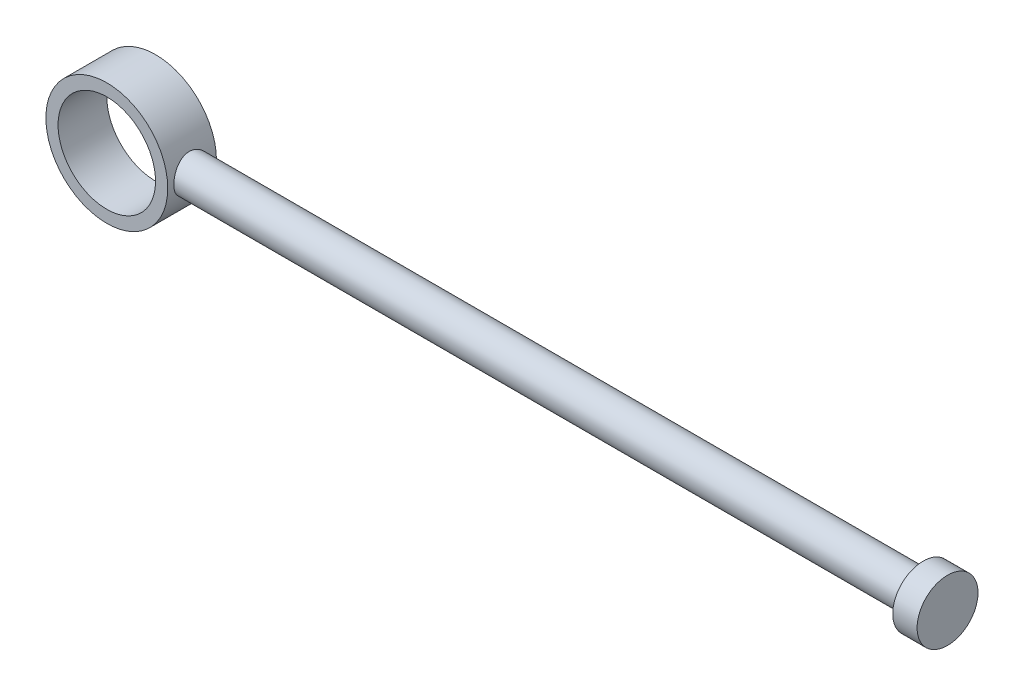
ISO-10303-21;
HEADER;
FILE_DESCRIPTION(('STEP AP214'),'2;1');
FILE_NAME('part.step','',(''),(''),'','','');
FILE_SCHEMA(('AUTOMOTIVE_DESIGN { 1 0 10303 214 1 1 1 1 }'));
ENDSEC;
DATA;
#1=APPLICATION_CONTEXT('core data for automotive mechanical design processes');
#2=APPLICATION_PROTOCOL_DEFINITION('international standard','automotive_design',2000,#1);
#3=PRODUCT_CONTEXT('',#1,'mechanical');
#4=PRODUCT('Part','Part','',(#3));
#5=PRODUCT_RELATED_PRODUCT_CATEGORY('part','',(#4));
#6=PRODUCT_DEFINITION_FORMATION('','',#4);
#7=PRODUCT_DEFINITION_CONTEXT('part definition',#1,'design');
#8=PRODUCT_DEFINITION('design','',#6,#7);
#9=PRODUCT_DEFINITION_SHAPE('','',#8);
#10=(LENGTH_UNIT() NAMED_UNIT(*) SI_UNIT(.MILLI.,.METRE.));
#11=(NAMED_UNIT(*) PLANE_ANGLE_UNIT() SI_UNIT($,.RADIAN.));
#12=(NAMED_UNIT(*) SI_UNIT($,.STERADIAN.) SOLID_ANGLE_UNIT());
#13=UNCERTAINTY_MEASURE_WITH_UNIT(LENGTH_MEASURE(1.E-05),#10,'distance_accuracy_value','');
#14=(GEOMETRIC_REPRESENTATION_CONTEXT(3) GLOBAL_UNCERTAINTY_ASSIGNED_CONTEXT((#13)) GLOBAL_UNIT_ASSIGNED_CONTEXT((#10,
#11,#12)) REPRESENTATION_CONTEXT('',''));
#15=CARTESIAN_POINT('',(0.,0.,0.));
#16=DIRECTION('',(0.,0.,1.));
#17=DIRECTION('',(1.,0.,0.));
#18=AXIS2_PLACEMENT_3D('',#15,#16,#17);
#19=CARTESIAN_POINT('',(0.,0.,4.));
#20=DIRECTION('',(0.,0.,-1.));
#21=DIRECTION('',(-1.,0.,0.));
#22=AXIS2_PLACEMENT_3D('',#19,#20,#21);
#23=CYLINDRICAL_SURFACE('',#22,5.);
#24=CARTESIAN_POINT('',(0.,0.,4.));
#25=DIRECTION('',(0.,0.,1.));
#26=DIRECTION('',(1.,0.,0.));
#27=AXIS2_PLACEMENT_3D('',#24,#25,#26);
#28=CIRCLE('',#27,5.);
#29=CARTESIAN_POINT('',(5.,0.,4.));
#30=VERTEX_POINT('',#29);
#31=EDGE_CURVE('E53',#30,#30,#28,.T.);
#32=ORIENTED_EDGE('',*,*,#31,.F.);
#33=EDGE_LOOP('',(#32));
#34=FACE_BOUND('',#33,.T.);
#35=CARTESIAN_POINT('',(0.,0.,0.));
#36=DIRECTION('',(0.,0.,1.));
#37=DIRECTION('',(1.,0.,0.));
#38=AXIS2_PLACEMENT_3D('',#35,#36,#37);
#39=CIRCLE('',#38,5.);
#40=CARTESIAN_POINT('',(5.,0.,0.));
#41=VERTEX_POINT('',#40);
#42=EDGE_CURVE('E58',#41,#41,#39,.T.);
#43=ORIENTED_EDGE('',*,*,#42,.T.);
#44=EDGE_LOOP('',(#43));
#45=FACE_BOUND('',#44,.T.);
#46=CARTESIAN_POINT('',(5.,0.,3.5));
#47=CARTESIAN_POINT('',(4.9999992925055,-0.0822886127532999,3.49999900251511));
#48=CARTESIAN_POINT('',(4.99794915693954,-0.164587318351529,3.49320613637603));
#49=CARTESIAN_POINT('',(4.98997105593691,-0.326788125304881,3.4662786457779));
#50=CARTESIAN_POINT('',(4.98404193389692,-0.40668950441142,3.44614004197666));
#51=CARTESIAN_POINT('',(4.96895552501836,-0.561732707754527,3.39325398308974));
#52=CARTESIAN_POINT('',(4.95980300250425,-0.636881364395373,3.36052513038106));
#53=CARTESIAN_POINT('',(4.93922109237645,-0.780624181053132,3.28346390694416));
#54=CARTESIAN_POINT('',(4.92779140192067,-0.84921746746967,3.23912999260458));
#55=CARTESIAN_POINT('',(4.90350737192774,-0.979871797183745,3.13877599252733));
#56=CARTESIAN_POINT('',(4.89062383657036,-1.04171807124434,3.08248337411409));
#57=CARTESIAN_POINT('',(4.86505834210442,-1.15524920923324,2.96039077008982));
#58=CARTESIAN_POINT('',(4.85237641724501,-1.20693236327441,2.89458918787504));
#59=CARTESIAN_POINT('',(4.82834113993772,-1.29980037723708,2.75352924696239));
#60=CARTESIAN_POINT('',(4.81702406663875,-1.34072309022213,2.67809153900926));
#61=CARTESIAN_POINT('',(4.79743620394031,-1.4092139477476,2.52101074576971));
#62=CARTESIAN_POINT('',(4.78916468313311,-1.43678529919973,2.43936915607202));
#63=CARTESIAN_POINT('',(4.77690870838434,-1.47701633682652,2.27460973386954));
#64=CARTESIAN_POINT('',(4.77281069324533,-1.49007196234677,2.19159725613606));
#65=CARTESIAN_POINT('',(4.76902789749767,-1.50213730614672,2.02446684378323));
#66=CARTESIAN_POINT('',(4.76934204760571,-1.50115042761078,1.94034918194091));
#67=CARTESIAN_POINT('',(4.77424744067778,-1.48546977199812,1.77661609139152));
#68=CARTESIAN_POINT('',(4.7786838859914,-1.47127205262685,1.69694774963776));
#69=CARTESIAN_POINT('',(4.79108356228624,-1.43037420427056,1.54118021372654));
#70=CARTESIAN_POINT('',(4.79904714132351,-1.40367284141641,1.46508137262567));
#71=CARTESIAN_POINT('',(4.81772733074973,-1.33816026653682,1.31739965033926));
#72=CARTESIAN_POINT('',(4.82848016115952,-1.29918816934642,1.24589291604474));
#73=CARTESIAN_POINT('',(4.85150987000065,-1.21035222588683,1.11026797798981));
#74=CARTESIAN_POINT('',(4.86378711746991,-1.16048574002588,1.04615157058622));
#75=CARTESIAN_POINT('',(4.88911011297937,-1.04881290765546,0.924313809237979));
#76=CARTESIAN_POINT('',(4.90216654310498,-0.986594907466972,0.866971335970329));
#77=CARTESIAN_POINT('',(4.92712244063259,-0.853263259313967,0.763446015935751));
#78=CARTESIAN_POINT('',(4.9390218351841,-0.782149051860888,0.717263871585573));
#79=CARTESIAN_POINT('',(4.9604316006947,-0.632355038342803,0.637140077535269));
#80=CARTESIAN_POINT('',(4.96992543668314,-0.55362774974795,0.603282483750139));
#81=CARTESIAN_POINT('',(4.98533521832222,-0.391245415603519,0.549400409900369));
#82=CARTESIAN_POINT('',(4.99125216186999,-0.307591751589581,0.52937207146751));
#83=CARTESIAN_POINT('',(4.99868364643538,-0.140952242668331,0.504347822100605));
#84=CARTESIAN_POINT('',(5.0003485041779,-0.0580500976011866,0.498838414198389));
#85=CARTESIAN_POINT('',(4.9995292324176,0.107499605823383,0.501569155712081));
#86=CARTESIAN_POINT('',(4.99704565677756,0.190147196690781,0.509807469651442));
#87=CARTESIAN_POINT('',(4.98830696987163,0.350903605309697,0.539384611111496));
#88=CARTESIAN_POINT('',(4.98213829799417,0.42907277261417,0.560423387580869));
#89=CARTESIAN_POINT('',(4.96674347841533,0.580754638954523,0.614643232778202));
#90=CARTESIAN_POINT('',(4.95751696321085,0.654266777025584,0.647825761037862));
#91=CARTESIAN_POINT('',(4.93669654351325,0.796437189461053,0.726253165481132));
#92=CARTESIAN_POINT('',(4.92505280829675,0.86494382619967,0.771759340947973));
#93=CARTESIAN_POINT('',(4.90073468764318,0.993523307980148,0.873224754052812));
#94=CARTESIAN_POINT('',(4.8880600443108,1.05359403235594,0.929186611887672));
#95=CARTESIAN_POINT('',(4.86253171869138,1.16585744551027,1.05238730836935));
#96=CARTESIAN_POINT('',(4.84968825033268,1.21768481231504,1.11996187577174));
#97=CARTESIAN_POINT('',(4.82576515238463,1.30928995072154,1.26312793901353));
#98=CARTESIAN_POINT('',(4.81468547654651,1.34906803829472,1.33871922455821));
#99=CARTESIAN_POINT('',(4.79567189615055,1.41517347127168,1.49553249125469));
#100=CARTESIAN_POINT('',(4.78772337843827,1.4415634693705,1.57672618653659));
#101=CARTESIAN_POINT('',(4.77591594362794,1.48021730815114,1.74268796893148));
#102=CARTESIAN_POINT('',(4.772055625083,1.49248598978779,1.82745482078767));
#103=CARTESIAN_POINT('',(4.76899972496087,1.50221984485059,1.99436151837623));
#104=CARTESIAN_POINT('',(4.76961647442754,1.5002805530849,2.07646365101759));
#105=CARTESIAN_POINT('',(4.77499401288294,1.48307505444813,2.2391141033728));
#106=CARTESIAN_POINT('',(4.77975463592551,1.46780938124716,2.31966248517635));
#107=CARTESIAN_POINT('',(4.79275763670385,1.42476888804136,2.47594539914285));
#108=CARTESIAN_POINT('',(4.80095604545965,1.39715175507068,2.55172728736169));
#109=CARTESIAN_POINT('',(4.81990278909136,1.33031507121129,2.69764243881772));
#110=CARTESIAN_POINT('',(4.83065161194312,1.29109329962876,2.76777461764076));
#111=CARTESIAN_POINT('',(4.85397676425833,1.20048763805072,2.90316311652711));
#112=CARTESIAN_POINT('',(4.86660540163798,1.14871276092994,2.96814876126041));
#113=CARTESIAN_POINT('',(4.89201320450026,1.03517434629782,3.08870249830786));
#114=CARTESIAN_POINT('',(4.90479240823905,0.973408217134501,3.14426813946776));
#115=CARTESIAN_POINT('',(4.92950936570649,0.839465762183248,3.24602341229503));
#116=CARTESIAN_POINT('',(4.94141159765674,0.767037885790608,3.29189144685549));
#117=CARTESIAN_POINT('',(4.96260680455813,0.615141373983529,3.37073516990402));
#118=CARTESIAN_POINT('',(4.97190099931067,0.535676052998954,3.40371688827451));
#119=CARTESIAN_POINT('',(4.98602174969301,0.380757712655281,3.45289527565275));
#120=CARTESIAN_POINT('',(4.99122027381068,0.305786961954234,3.47051167288325));
#121=CARTESIAN_POINT('',(4.99820944494492,0.15388019523078,3.49406352524158));
#122=CARTESIAN_POINT('',(5.0000006615474,0.0769445098581397,3.50000093270482));
#123=CARTESIAN_POINT('',(5.,0.,3.5));
#124=B_SPLINE_CURVE_WITH_KNOTS('',3,(#46,#47,#48,#49,#50,#51,#52,#53,#54,#55,#56,#57,#58,#59,
#60,#61,#62,#63,#64,#65,#66,#67,#68,#69,#70,#71,#72,#73,#74,#75,#76,#77,#78,#79,#80,#81,#82,#83,
#84,#85,#86,#87,#88,#89,#90,#91,#92,#93,#94,#95,#96,#97,#98,#99,#100,#101,#102,#103,#104,#105,
#106,#107,#108,#109,#110,#111,#112,#113,#114,#115,#116,#117,#118,#119,#120,#121,#122,#123),
.UNSPECIFIED.,.T.,.F.,(4,2,2,2,2,2,2,2,2,2,2,2,2,2,2,2,2,2,2,2,2,2,2,2,2,2,2,2,2,2,2,2,2,2,2,2,
2,2,4),(0.,0.246583203612611,0.493239964846,0.739533676300875,0.985860164412702,
1.23855602948192,1.49129437288633,1.74971481004109,2.00807314543224,2.25919689356599,
2.51025978319089,2.75226016697676,2.99428443658001,3.2396242644712,3.48502360158556,
3.74067104048167,3.99633456531072,4.25371046881689,4.51101453528808,4.75908809438545,
5.00712853550327,5.24956746682327,5.49203554593729,5.74011305702908,5.98825282000191,
6.24540400322819,6.50254844252681,6.75847814951252,7.01432009460283,7.25950155466943,
7.504673196616,7.74680040402721,7.98897397553107,8.23996925679931,8.49102974897502,
8.74942996156671,9.00770911595235,9.23831691930459,9.46888616948874),.UNSPECIFIED.);
#125=CARTESIAN_POINT('',(5.,0.,3.5));
#126=VERTEX_POINT('',#125);
#127=EDGE_CURVE('E10',#126,#126,#124,.T.);
#128=ORIENTED_EDGE('',*,*,#127,.F.);
#129=EDGE_LOOP('',(#128));
#130=FACE_BOUND('',#129,.T.);
#131=ADVANCED_FACE('F41',(#34,#45,#130),#23,.T.);
#132=CARTESIAN_POINT('',(0.,0.,4.));
#133=DIRECTION('',(0.,0.,1.));
#134=DIRECTION('',(1.,0.,0.));
#135=AXIS2_PLACEMENT_3D('',#132,#133,#134);
#136=PLANE('',#135);
#137=ORIENTED_EDGE('',*,*,#31,.T.);
#138=EDGE_LOOP('',(#137));
#139=FACE_BOUND('',#138,.T.);
#140=CARTESIAN_POINT('',(0.,0.,4.));
#141=DIRECTION('',(0.,0.,1.));
#142=DIRECTION('',(1.,0.,0.));
#143=AXIS2_PLACEMENT_3D('',#140,#141,#142);
#144=CIRCLE('',#143,4.);
#145=CARTESIAN_POINT('',(4.,0.,4.));
#146=VERTEX_POINT('',#145);
#147=EDGE_CURVE('E64',#146,#146,#144,.T.);
#148=ORIENTED_EDGE('',*,*,#147,.F.);
#149=EDGE_LOOP('',(#148));
#150=FACE_BOUND('',#149,.T.);
#151=ADVANCED_FACE('F104',(#139,#150),#136,.T.);
#152=CARTESIAN_POINT('',(0.,0.,0.));
#153=DIRECTION('',(0.,0.,1.));
#154=DIRECTION('',(1.,0.,0.));
#155=AXIS2_PLACEMENT_3D('',#152,#153,#154);
#156=PLANE('',#155);
#157=ORIENTED_EDGE('',*,*,#42,.F.);
#158=EDGE_LOOP('',(#157));
#159=FACE_BOUND('',#158,.T.);
#160=CARTESIAN_POINT('',(0.,0.,0.));
#161=DIRECTION('',(0.,0.,1.));
#162=DIRECTION('',(1.,0.,0.));
#163=AXIS2_PLACEMENT_3D('',#160,#161,#162);
#164=CIRCLE('',#163,4.);
#165=CARTESIAN_POINT('',(4.,0.,0.));
#166=VERTEX_POINT('',#165);
#167=EDGE_CURVE('E66',#166,#166,#164,.T.);
#168=ORIENTED_EDGE('',*,*,#167,.T.);
#169=EDGE_LOOP('',(#168));
#170=FACE_BOUND('',#169,.T.);
#171=ADVANCED_FACE('F109',(#159,#170),#156,.F.);
#172=CARTESIAN_POINT('',(0.,0.,4.));
#173=DIRECTION('',(0.,0.,-1.));
#174=DIRECTION('',(-1.,0.,0.));
#175=AXIS2_PLACEMENT_3D('',#172,#173,#174);
#176=CYLINDRICAL_SURFACE('',#175,4.);
#177=ORIENTED_EDGE('',*,*,#147,.T.);
#178=EDGE_LOOP('',(#177));
#179=FACE_BOUND('',#178,.T.);
#180=ORIENTED_EDGE('',*,*,#167,.F.);
#181=EDGE_LOOP('',(#180));
#182=FACE_BOUND('',#181,.T.);
#183=ADVANCED_FACE('F117',(#179,#182),#176,.F.);
#184=CARTESIAN_POINT('',(65.,0.,2.));
#185=DIRECTION('',(-1.,0.,0.));
#186=DIRECTION('',(0.,0.,1.));
#187=AXIS2_PLACEMENT_3D('',#184,#185,#186);
#188=CYLINDRICAL_SURFACE('',#187,1.5);
#189=CARTESIAN_POINT('',(65.,0.,2.));
#190=DIRECTION('',(1.,0.,0.));
#191=DIRECTION('',(0.,0.,-1.));
#192=AXIS2_PLACEMENT_3D('',#189,#190,#191);
#193=CIRCLE('',#192,1.5);
#194=CARTESIAN_POINT('',(65.,0.,0.5));
#195=VERTEX_POINT('',#194);
#196=EDGE_CURVE('E70',#195,#195,#193,.T.);
#197=ORIENTED_EDGE('',*,*,#196,.F.);
#198=EDGE_LOOP('',(#197));
#199=FACE_BOUND('',#198,.T.);
#200=ORIENTED_EDGE('',*,*,#127,.T.);
#201=EDGE_LOOP('',(#200));
#202=FACE_BOUND('',#201,.T.);
#203=ADVANCED_FACE('F91',(#199,#202),#188,.T.);
#204=CARTESIAN_POINT('',(67.,0.,2.));
#205=DIRECTION('',(-1.,0.,0.));
#206=DIRECTION('',(0.,0.,1.));
#207=AXIS2_PLACEMENT_3D('',#204,#205,#206);
#208=CYLINDRICAL_SURFACE('',#207,2.5);
#209=CARTESIAN_POINT('',(67.,0.,2.));
#210=DIRECTION('',(1.,0.,0.));
#211=DIRECTION('',(0.,0.,-1.));
#212=AXIS2_PLACEMENT_3D('',#209,#210,#211);
#213=CIRCLE('',#212,2.5);
#214=CARTESIAN_POINT('',(67.,0.,-0.5));
#215=VERTEX_POINT('',#214);
#216=EDGE_CURVE('E77',#215,#215,#213,.T.);
#217=ORIENTED_EDGE('',*,*,#216,.F.);
#218=EDGE_LOOP('',(#217));
#219=FACE_BOUND('',#218,.T.);
#220=CARTESIAN_POINT('',(65.,0.,2.));
#221=DIRECTION('',(1.,0.,0.));
#222=DIRECTION('',(0.,0.,-1.));
#223=AXIS2_PLACEMENT_3D('',#220,#221,#222);
#224=CIRCLE('',#223,2.5);
#225=CARTESIAN_POINT('',(65.,0.,-0.5));
#226=VERTEX_POINT('',#225);
#227=EDGE_CURVE('E78',#226,#226,#224,.T.);
#228=ORIENTED_EDGE('',*,*,#227,.T.);
#229=EDGE_LOOP('',(#228));
#230=FACE_BOUND('',#229,.T.);
#231=ADVANCED_FACE('F88',(#219,#230),#208,.T.);
#232=CARTESIAN_POINT('',(67.,0.,2.));
#233=DIRECTION('',(1.,0.,0.));
#234=DIRECTION('',(0.,0.,-1.));
#235=AXIS2_PLACEMENT_3D('',#232,#233,#234);
#236=PLANE('',#235);
#237=ORIENTED_EDGE('',*,*,#216,.T.);
#238=EDGE_LOOP('',(#237));
#239=FACE_BOUND('',#238,.T.);
#240=ADVANCED_FACE('F86',(#239),#236,.T.);
#241=CARTESIAN_POINT('',(65.,0.,2.));
#242=DIRECTION('',(1.,0.,0.));
#243=DIRECTION('',(0.,0.,-1.));
#244=AXIS2_PLACEMENT_3D('',#241,#242,#243);
#245=PLANE('',#244);
#246=ORIENTED_EDGE('',*,*,#196,.T.);
#247=EDGE_LOOP('',(#246));
#248=FACE_BOUND('',#247,.T.);
#249=ORIENTED_EDGE('',*,*,#227,.F.);
#250=EDGE_LOOP('',(#249));
#251=FACE_BOUND('',#250,.T.);
#252=ADVANCED_FACE('F95',(#248,#251),#245,.F.);
#253=CLOSED_SHELL('',(#131,#151,#171,#183,#203,#231,#240,#252));
#254=MANIFOLD_SOLID_BREP('B2',#253);
#255=ADVANCED_BREP_SHAPE_REPRESENTATION('',(#18,#254),#14);
#256=SHAPE_DEFINITION_REPRESENTATION(#9,#255);
ENDSEC;
END-ISO-10303-21;
